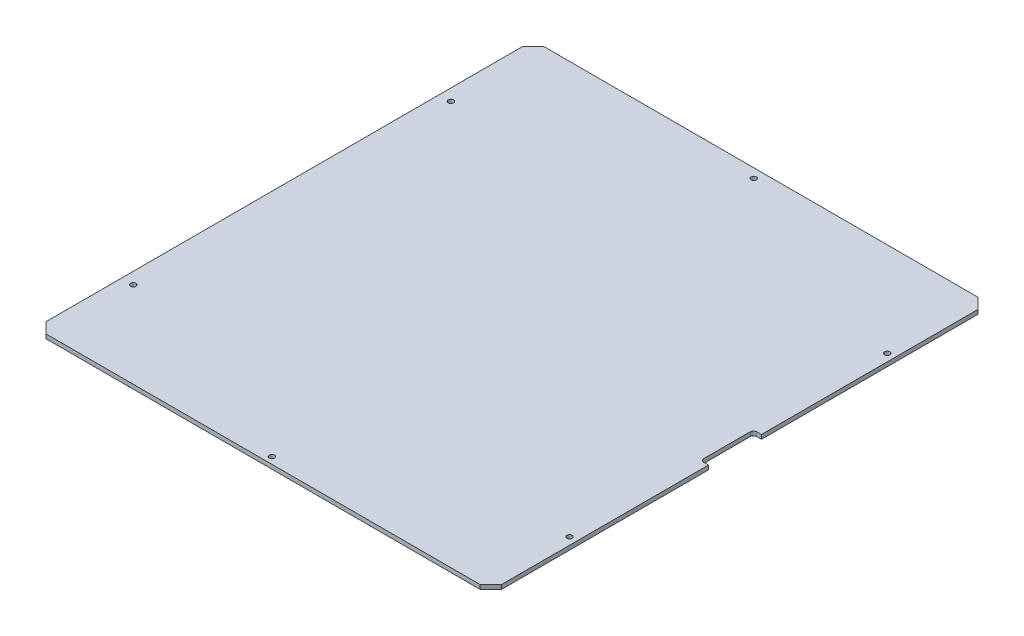
ISO-10303-21;
HEADER;
FILE_DESCRIPTION(('STEP AP214'),'2;1');
FILE_NAME('part.step','',(''),(''),'','','');
FILE_SCHEMA(('AUTOMOTIVE_DESIGN { 1 0 10303 214 1 1 1 1 }'));
ENDSEC;
DATA;
#1=APPLICATION_CONTEXT('core data for automotive mechanical design processes');
#2=APPLICATION_PROTOCOL_DEFINITION('international standard','automotive_design',2000,#1);
#3=PRODUCT_CONTEXT('',#1,'mechanical');
#4=PRODUCT('Part','Part','',(#3));
#5=PRODUCT_RELATED_PRODUCT_CATEGORY('part','',(#4));
#6=PRODUCT_DEFINITION_FORMATION('','',#4);
#7=PRODUCT_DEFINITION_CONTEXT('part definition',#1,'design');
#8=PRODUCT_DEFINITION('design','',#6,#7);
#9=PRODUCT_DEFINITION_SHAPE('','',#8);
#10=(LENGTH_UNIT() NAMED_UNIT(*) SI_UNIT(.MILLI.,.METRE.));
#11=(NAMED_UNIT(*) PLANE_ANGLE_UNIT() SI_UNIT($,.RADIAN.));
#12=(NAMED_UNIT(*) SI_UNIT($,.STERADIAN.) SOLID_ANGLE_UNIT());
#13=UNCERTAINTY_MEASURE_WITH_UNIT(LENGTH_MEASURE(1.E-05),#10,'distance_accuracy_value','');
#14=(GEOMETRIC_REPRESENTATION_CONTEXT(3) GLOBAL_UNCERTAINTY_ASSIGNED_CONTEXT((#13)) GLOBAL_UNIT_ASSIGNED_CONTEXT((#10,
#11,#12)) REPRESENTATION_CONTEXT('',''));
#15=CARTESIAN_POINT('',(0.,0.,0.));
#16=DIRECTION('',(0.,0.,1.));
#17=DIRECTION('',(1.,0.,0.));
#18=AXIS2_PLACEMENT_3D('',#15,#16,#17);
#19=CARTESIAN_POINT('',(0.,-176.5,0.));
#20=DIRECTION('',(0.,-1.,0.));
#21=DIRECTION('',(0.,0.,-1.));
#22=AXIS2_PLACEMENT_3D('',#19,#20,#21);
#23=PLANE('',#22);
#24=CARTESIAN_POINT('',(1.99999999999029,-176.5,686.5));
#25=DIRECTION('',(0.,-1.,0.));
#26=DIRECTION('',(0.,0.,-1.));
#27=AXIS2_PLACEMENT_3D('',#24,#25,#26);
#28=CIRCLE('',#27,2.49999999999995);
#29=CARTESIAN_POINT('',(1.99999999999029,-176.5,684.));
#30=VERTEX_POINT('',#29);
#31=EDGE_CURVE('E229',#30,#30,#28,.F.);
#32=ORIENTED_EDGE('',*,*,#31,.T.);
#33=EDGE_LOOP('',(#32));
#34=FACE_BOUND('',#33,.T.);
#35=CARTESIAN_POINT('',(207.99999999999,-176.5,611.5));
#36=DIRECTION('',(0.,-1.,0.));
#37=DIRECTION('',(0.,0.,-1.));
#38=AXIS2_PLACEMENT_3D('',#35,#36,#37);
#39=CIRCLE('',#38,2.49999999999995);
#40=CARTESIAN_POINT('',(207.99999999999,-176.5,609.));
#41=VERTEX_POINT('',#40);
#42=EDGE_CURVE('E301',#41,#41,#39,.F.);
#43=ORIENTED_EDGE('',*,*,#42,.T.);
#44=EDGE_LOOP('',(#43));
#45=FACE_BOUND('',#44,.T.);
#46=CARTESIAN_POINT('',(-204.00000000001,-176.5,311.5));
#47=DIRECTION('',(0.,-1.,0.));
#48=DIRECTION('',(0.,0.,-1.));
#49=AXIS2_PLACEMENT_3D('',#46,#47,#48);
#50=CIRCLE('',#49,2.5);
#51=CARTESIAN_POINT('',(-204.00000000001,-176.5,309.));
#52=VERTEX_POINT('',#51);
#53=EDGE_CURVE('E307',#52,#52,#50,.F.);
#54=ORIENTED_EDGE('',*,*,#53,.T.);
#55=EDGE_LOOP('',(#54));
#56=FACE_BOUND('',#55,.T.);
#57=CARTESIAN_POINT('',(1.99999999999029,-176.5,231.5));
#58=DIRECTION('',(0.,-1.,0.));
#59=DIRECTION('',(0.,0.,-1.));
#60=AXIS2_PLACEMENT_3D('',#57,#58,#59);
#61=CIRCLE('',#60,2.5);
#62=CARTESIAN_POINT('',(1.99999999999029,-176.5,229.));
#63=VERTEX_POINT('',#62);
#64=EDGE_CURVE('E245',#63,#63,#61,.F.);
#65=ORIENTED_EDGE('',*,*,#64,.T.);
#66=EDGE_LOOP('',(#65));
#67=FACE_BOUND('',#66,.T.);
#68=CARTESIAN_POINT('',(-204.00000000001,-176.5,611.5));
#69=DIRECTION('',(0.,-1.,0.));
#70=DIRECTION('',(0.,0.,-1.));
#71=AXIS2_PLACEMENT_3D('',#68,#69,#70);
#72=CIRCLE('',#71,2.49999999999995);
#73=CARTESIAN_POINT('',(-204.00000000001,-176.5,609.));
#74=VERTEX_POINT('',#73);
#75=EDGE_CURVE('E304',#74,#74,#72,.F.);
#76=ORIENTED_EDGE('',*,*,#75,.T.);
#77=EDGE_LOOP('',(#76));
#78=FACE_BOUND('',#77,.T.);
#79=CARTESIAN_POINT('',(207.99999999999,-176.5,311.5));
#80=DIRECTION('',(0.,-1.,0.));
#81=DIRECTION('',(0.,0.,-1.));
#82=AXIS2_PLACEMENT_3D('',#79,#80,#81);
#83=CIRCLE('',#82,2.5);
#84=CARTESIAN_POINT('',(207.99999999999,-176.5,309.));
#85=VERTEX_POINT('',#84);
#86=EDGE_CURVE('E298',#85,#85,#83,.F.);
#87=ORIENTED_EDGE('',*,*,#86,.T.);
#88=EDGE_LOOP('',(#87));
#89=FACE_BOUND('',#88,.T.);
#90=DIRECTION('',(0.,0.,1.));
#91=VECTOR('',#90,1.);
#92=CARTESIAN_POINT('',(207.500000000561,-176.5,440.250000000085));
#93=LINE('',#92,#91);
#94=CARTESIAN_POINT('',(207.500000000561,-176.5,440.250000000085));
#95=VERTEX_POINT('',#94);
#96=CARTESIAN_POINT('',(207.500000000561,-176.5,484.250000000085));
#97=VERTEX_POINT('',#96);
#98=EDGE_CURVE('E119',#95,#97,#93,.T.);
#99=ORIENTED_EDGE('',*,*,#98,.T.);
#100=CARTESIAN_POINT('',(210.500000000561,-176.5,484.250000000085));
#101=DIRECTION('',(0.,1.,0.));
#102=DIRECTION('',(0.,0.,1.));
#103=AXIS2_PLACEMENT_3D('',#100,#101,#102);
#104=CIRCLE('',#103,3.);
#105=CARTESIAN_POINT('',(210.500000000561,-176.5,487.250000000085));
#106=VERTEX_POINT('',#105);
#107=EDGE_CURVE('E311',#97,#106,#104,.T.);
#108=ORIENTED_EDGE('',*,*,#107,.T.);
#109=DIRECTION('',(1.,0.,0.));
#110=VECTOR('',#109,1.);
#111=CARTESIAN_POINT('',(210.500000000561,-176.5,487.250000000085));
#112=LINE('',#111,#110);
#113=CARTESIAN_POINT('',(215.,-176.5,487.250000000085));
#114=VERTEX_POINT('',#113);
#115=EDGE_CURVE('E235',#106,#114,#112,.T.);
#116=ORIENTED_EDGE('',*,*,#115,.T.);
#117=DIRECTION('',(0.,0.,1.));
#118=VECTOR('',#117,1.);
#119=CARTESIAN_POINT('',(215.,-176.5,232.8));
#120=LINE('',#119,#118);
#121=CARTESIAN_POINT('',(215.,-176.5,682.8));
#122=VERTEX_POINT('',#121);
#123=EDGE_CURVE('E242',#114,#122,#120,.T.);
#124=ORIENTED_EDGE('',*,*,#123,.T.);
#125=DIRECTION('',(-0.707106781186548,0.,0.707106781186548));
#126=VECTOR('',#125,1.);
#127=CARTESIAN_POINT('',(215.,-176.5,682.8));
#128=LINE('',#127,#126);
#129=CARTESIAN_POINT('',(205.,-176.5,692.8));
#130=VERTEX_POINT('',#129);
#131=EDGE_CURVE('E224',#122,#130,#128,.T.);
#132=ORIENTED_EDGE('',*,*,#131,.T.);
#133=DIRECTION('',(-1.,0.,0.));
#134=VECTOR('',#133,1.);
#135=CARTESIAN_POINT('',(-205.,-176.5,692.8));
#136=LINE('',#135,#134);
#137=CARTESIAN_POINT('',(-205.,-176.5,692.8));
#138=VERTEX_POINT('',#137);
#139=EDGE_CURVE('E213',#130,#138,#136,.T.);
#140=ORIENTED_EDGE('',*,*,#139,.T.);
#141=DIRECTION('',(-0.707106781186549,0.,-0.707106781186547));
#142=VECTOR('',#141,1.);
#143=CARTESIAN_POINT('',(-215.,-176.5,682.8));
#144=LINE('',#143,#142);
#145=CARTESIAN_POINT('',(-215.,-176.5,682.8));
#146=VERTEX_POINT('',#145);
#147=EDGE_CURVE('E202',#138,#146,#144,.T.);
#148=ORIENTED_EDGE('',*,*,#147,.T.);
#149=DIRECTION('',(0.,0.,-1.));
#150=VECTOR('',#149,1.);
#151=CARTESIAN_POINT('',(-215.,-176.5,232.8));
#152=LINE('',#151,#150);
#153=CARTESIAN_POINT('',(-215.,-176.5,232.8));
#154=VERTEX_POINT('',#153);
#155=EDGE_CURVE('E191',#146,#154,#152,.T.);
#156=ORIENTED_EDGE('',*,*,#155,.T.);
#157=DIRECTION('',(0.707106781186548,0.,-0.707106781186548));
#158=VECTOR('',#157,1.);
#159=CARTESIAN_POINT('',(-215.,-176.5,232.8));
#160=LINE('',#159,#158);
#161=CARTESIAN_POINT('',(-205.,-176.5,222.8));
#162=VERTEX_POINT('',#161);
#163=EDGE_CURVE('E180',#154,#162,#160,.T.);
#164=ORIENTED_EDGE('',*,*,#163,.T.);
#165=DIRECTION('',(1.,0.,0.));
#166=VECTOR('',#165,1.);
#167=CARTESIAN_POINT('',(-205.,-176.5,222.8));
#168=LINE('',#167,#166);
#169=CARTESIAN_POINT('',(205.,-176.5,222.8));
#170=VERTEX_POINT('',#169);
#171=EDGE_CURVE('E169',#162,#170,#168,.T.);
#172=ORIENTED_EDGE('',*,*,#171,.T.);
#173=DIRECTION('',(0.707106781186542,0.,0.707106781186553));
#174=VECTOR('',#173,1.);
#175=CARTESIAN_POINT('',(205.,-176.5,222.8));
#176=LINE('',#175,#174);
#177=CARTESIAN_POINT('',(215.,-176.5,232.8));
#178=VERTEX_POINT('',#177);
#179=EDGE_CURVE('E158',#170,#178,#176,.T.);
#180=ORIENTED_EDGE('',*,*,#179,.T.);
#181=DIRECTION('',(0.,0.,1.));
#182=VECTOR('',#181,1.);
#183=CARTESIAN_POINT('',(215.,-176.5,232.8));
#184=LINE('',#183,#182);
#185=CARTESIAN_POINT('',(215.,-176.5,437.250000000086));
#186=VERTEX_POINT('',#185);
#187=EDGE_CURVE('E145',#178,#186,#184,.T.);
#188=ORIENTED_EDGE('',*,*,#187,.T.);
#189=DIRECTION('',(-1.,0.,0.));
#190=VECTOR('',#189,1.);
#191=CARTESIAN_POINT('',(210.500000000561,-176.5,437.250000000085));
#192=LINE('',#191,#190);
#193=CARTESIAN_POINT('',(210.500000000561,-176.5,437.250000000085));
#194=VERTEX_POINT('',#193);
#195=EDGE_CURVE('E116',#186,#194,#192,.T.);
#196=ORIENTED_EDGE('',*,*,#195,.T.);
#197=CARTESIAN_POINT('',(210.500000000561,-176.5,440.250000000085));
#198=DIRECTION('',(0.,1.,0.));
#199=DIRECTION('',(0.,0.,1.));
#200=AXIS2_PLACEMENT_3D('',#197,#198,#199);
#201=CIRCLE('',#200,3.);
#202=EDGE_CURVE('E20',#194,#95,#201,.T.);
#203=ORIENTED_EDGE('',*,*,#202,.T.);
#204=EDGE_LOOP('',(#99,#108,#116,#124,#132,#140,#148,#156,#164,#172,#180,#188,#196,#203));
#205=FACE_BOUND('',#204,.T.);
#206=ADVANCED_FACE('F17',(#34,#45,#56,#67,#78,#89,#205),#23,.T.);
#207=CARTESIAN_POINT('',(215.,-172.5,682.8));
#208=DIRECTION('',(-0.707106781186548,0.,-0.707106781186548));
#209=DIRECTION('',(-0.707106781186548,0.,0.707106781186548));
#210=AXIS2_PLACEMENT_3D('',#207,#208,#209);
#211=PLANE('',#210);
#212=DIRECTION('',(0.,1.,0.));
#213=VECTOR('',#212,1.);
#214=CARTESIAN_POINT('',(215.,-172.5,682.8));
#215=LINE('',#214,#213);
#216=CARTESIAN_POINT('',(215.,-172.5,682.8));
#217=VERTEX_POINT('',#216);
#218=EDGE_CURVE('E232',#122,#217,#215,.T.);
#219=ORIENTED_EDGE('',*,*,#218,.T.);
#220=DIRECTION('',(-0.707106781186547,0.,0.707106781186547));
#221=VECTOR('',#220,1.);
#222=CARTESIAN_POINT('',(215.,-172.5,682.8));
#223=LINE('',#222,#221);
#224=CARTESIAN_POINT('',(205.,-172.5,692.8));
#225=VERTEX_POINT('',#224);
#226=EDGE_CURVE('E218',#217,#225,#223,.T.);
#227=ORIENTED_EDGE('',*,*,#226,.T.);
#228=DIRECTION('',(0.,1.,0.));
#229=VECTOR('',#228,1.);
#230=CARTESIAN_POINT('',(205.,-172.5,692.8));
#231=LINE('',#230,#229);
#232=EDGE_CURVE('E221',#225,#130,#231,.F.);
#233=ORIENTED_EDGE('',*,*,#232,.T.);
#234=ORIENTED_EDGE('',*,*,#131,.F.);
#235=EDGE_LOOP('',(#219,#227,#233,#234));
#236=FACE_BOUND('',#235,.T.);
#237=ADVANCED_FACE('F368',(#236),#211,.F.);
#238=CARTESIAN_POINT('',(-205.,-172.5,692.8));
#239=DIRECTION('',(0.,0.,-1.));
#240=DIRECTION('',(-1.,0.,0.));
#241=AXIS2_PLACEMENT_3D('',#238,#239,#240);
#242=PLANE('',#241);
#243=ORIENTED_EDGE('',*,*,#232,.F.);
#244=DIRECTION('',(1.,0.,0.));
#245=VECTOR('',#244,1.);
#246=CARTESIAN_POINT('',(0.,-172.5,692.8));
#247=LINE('',#246,#245);
#248=CARTESIAN_POINT('',(-205.,-172.5,692.8));
#249=VERTEX_POINT('',#248);
#250=EDGE_CURVE('E207',#225,#249,#247,.F.);
#251=ORIENTED_EDGE('',*,*,#250,.T.);
#252=DIRECTION('',(0.,1.,0.));
#253=VECTOR('',#252,1.);
#254=CARTESIAN_POINT('',(-205.,-172.5,692.8));
#255=LINE('',#254,#253);
#256=EDGE_CURVE('E210',#249,#138,#255,.F.);
#257=ORIENTED_EDGE('',*,*,#256,.T.);
#258=ORIENTED_EDGE('',*,*,#139,.F.);
#259=EDGE_LOOP('',(#243,#251,#257,#258));
#260=FACE_BOUND('',#259,.T.);
#261=ADVANCED_FACE('F365',(#260),#242,.F.);
#262=CARTESIAN_POINT('',(-215.,-172.5,682.8));
#263=DIRECTION('',(0.707106781186547,0.,-0.707106781186549));
#264=DIRECTION('',(-0.707106781186549,0.,-0.707106781186547));
#265=AXIS2_PLACEMENT_3D('',#262,#263,#264);
#266=PLANE('',#265);
#267=ORIENTED_EDGE('',*,*,#256,.F.);
#268=DIRECTION('',(-0.707106781186547,0.,-0.707106781186547));
#269=VECTOR('',#268,1.);
#270=CARTESIAN_POINT('',(-205.,-172.5,692.8));
#271=LINE('',#270,#269);
#272=CARTESIAN_POINT('',(-215.,-172.5,682.8));
#273=VERTEX_POINT('',#272);
#274=EDGE_CURVE('E196',#249,#273,#271,.T.);
#275=ORIENTED_EDGE('',*,*,#274,.T.);
#276=DIRECTION('',(0.,1.,0.));
#277=VECTOR('',#276,1.);
#278=CARTESIAN_POINT('',(-215.,-172.5,682.8));
#279=LINE('',#278,#277);
#280=EDGE_CURVE('E199',#273,#146,#279,.F.);
#281=ORIENTED_EDGE('',*,*,#280,.T.);
#282=ORIENTED_EDGE('',*,*,#147,.F.);
#283=EDGE_LOOP('',(#267,#275,#281,#282));
#284=FACE_BOUND('',#283,.T.);
#285=ADVANCED_FACE('F362',(#284),#266,.F.);
#286=CARTESIAN_POINT('',(-215.,-172.5,232.8));
#287=DIRECTION('',(1.,0.,0.));
#288=DIRECTION('',(0.,0.,-1.));
#289=AXIS2_PLACEMENT_3D('',#286,#287,#288);
#290=PLANE('',#289);
#291=ORIENTED_EDGE('',*,*,#280,.F.);
#292=DIRECTION('',(0.,0.,-1.));
#293=VECTOR('',#292,1.);
#294=CARTESIAN_POINT('',(-215.,-172.5,0.));
#295=LINE('',#294,#293);
#296=CARTESIAN_POINT('',(-215.,-172.5,232.8));
#297=VERTEX_POINT('',#296);
#298=EDGE_CURVE('E185',#273,#297,#295,.T.);
#299=ORIENTED_EDGE('',*,*,#298,.T.);
#300=DIRECTION('',(0.,1.,0.));
#301=VECTOR('',#300,1.);
#302=CARTESIAN_POINT('',(-215.,-172.5,232.8));
#303=LINE('',#302,#301);
#304=EDGE_CURVE('E188',#297,#154,#303,.F.);
#305=ORIENTED_EDGE('',*,*,#304,.T.);
#306=ORIENTED_EDGE('',*,*,#155,.F.);
#307=EDGE_LOOP('',(#291,#299,#305,#306));
#308=FACE_BOUND('',#307,.T.);
#309=ADVANCED_FACE('F358',(#308),#290,.F.);
#310=CARTESIAN_POINT('',(-215.,-172.5,232.8));
#311=DIRECTION('',(0.707106781186548,0.,0.707106781186548));
#312=DIRECTION('',(0.707106781186548,0.,-0.707106781186548));
#313=AXIS2_PLACEMENT_3D('',#310,#311,#312);
#314=PLANE('',#313);
#315=ORIENTED_EDGE('',*,*,#304,.F.);
#316=DIRECTION('',(0.707106781186547,0.,-0.707106781186547));
#317=VECTOR('',#316,1.);
#318=CARTESIAN_POINT('',(-215.,-172.5,232.8));
#319=LINE('',#318,#317);
#320=CARTESIAN_POINT('',(-205.,-172.5,222.8));
#321=VERTEX_POINT('',#320);
#322=EDGE_CURVE('E174',#297,#321,#319,.T.);
#323=ORIENTED_EDGE('',*,*,#322,.T.);
#324=DIRECTION('',(0.,1.,0.));
#325=VECTOR('',#324,1.);
#326=CARTESIAN_POINT('',(-205.,-172.5,222.8));
#327=LINE('',#326,#325);
#328=EDGE_CURVE('E177',#321,#162,#327,.F.);
#329=ORIENTED_EDGE('',*,*,#328,.T.);
#330=ORIENTED_EDGE('',*,*,#163,.F.);
#331=EDGE_LOOP('',(#315,#323,#329,#330));
#332=FACE_BOUND('',#331,.T.);
#333=ADVANCED_FACE('F354',(#332),#314,.F.);
#334=CARTESIAN_POINT('',(-205.,-172.5,222.8));
#335=DIRECTION('',(0.,0.,1.));
#336=DIRECTION('',(1.,0.,0.));
#337=AXIS2_PLACEMENT_3D('',#334,#335,#336);
#338=PLANE('',#337);
#339=ORIENTED_EDGE('',*,*,#328,.F.);
#340=DIRECTION('',(1.,0.,0.));
#341=VECTOR('',#340,1.);
#342=CARTESIAN_POINT('',(0.,-172.5,222.8));
#343=LINE('',#342,#341);
#344=CARTESIAN_POINT('',(205.,-172.5,222.8));
#345=VERTEX_POINT('',#344);
#346=EDGE_CURVE('E163',#321,#345,#343,.T.);
#347=ORIENTED_EDGE('',*,*,#346,.T.);
#348=DIRECTION('',(0.,1.,0.));
#349=VECTOR('',#348,1.);
#350=CARTESIAN_POINT('',(205.,-172.5,222.8));
#351=LINE('',#350,#349);
#352=EDGE_CURVE('E166',#345,#170,#351,.F.);
#353=ORIENTED_EDGE('',*,*,#352,.T.);
#354=ORIENTED_EDGE('',*,*,#171,.F.);
#355=EDGE_LOOP('',(#339,#347,#353,#354));
#356=FACE_BOUND('',#355,.T.);
#357=ADVANCED_FACE('F350',(#356),#338,.F.);
#358=CARTESIAN_POINT('',(205.,-172.5,222.8));
#359=DIRECTION('',(-0.707106781186553,0.,0.707106781186542));
#360=DIRECTION('',(0.707106781186542,0.,0.707106781186553));
#361=AXIS2_PLACEMENT_3D('',#358,#359,#360);
#362=PLANE('',#361);
#363=ORIENTED_EDGE('',*,*,#352,.F.);
#364=DIRECTION('',(0.707106781186542,0.,0.707106781186553));
#365=VECTOR('',#364,1.);
#366=CARTESIAN_POINT('',(205.,-172.5,222.8));
#367=LINE('',#366,#365);
#368=CARTESIAN_POINT('',(215.,-172.5,232.8));
#369=VERTEX_POINT('',#368);
#370=EDGE_CURVE('E152',#345,#369,#367,.T.);
#371=ORIENTED_EDGE('',*,*,#370,.T.);
#372=DIRECTION('',(0.,1.,0.));
#373=VECTOR('',#372,1.);
#374=CARTESIAN_POINT('',(215.,-172.5,232.8));
#375=LINE('',#374,#373);
#376=EDGE_CURVE('E155',#369,#178,#375,.F.);
#377=ORIENTED_EDGE('',*,*,#376,.T.);
#378=ORIENTED_EDGE('',*,*,#179,.F.);
#379=EDGE_LOOP('',(#363,#371,#377,#378));
#380=FACE_BOUND('',#379,.T.);
#381=ADVANCED_FACE('F346',(#380),#362,.F.);
#382=CARTESIAN_POINT('',(215.,-172.5,232.8));
#383=DIRECTION('',(-1.,0.,0.));
#384=DIRECTION('',(0.,0.,1.));
#385=AXIS2_PLACEMENT_3D('',#382,#383,#384);
#386=PLANE('',#385);
#387=DIRECTION('',(0.,1.,0.));
#388=VECTOR('',#387,1.);
#389=CARTESIAN_POINT('',(215.,-289.5,437.250000000085));
#390=LINE('',#389,#388);
#391=CARTESIAN_POINT('',(215.,-172.5,437.250000000086));
#392=VERTEX_POINT('',#391);
#393=EDGE_CURVE('E142',#392,#186,#390,.F.);
#394=ORIENTED_EDGE('',*,*,#393,.T.);
#395=ORIENTED_EDGE('',*,*,#187,.F.);
#396=ORIENTED_EDGE('',*,*,#376,.F.);
#397=DIRECTION('',(0.,0.,-1.));
#398=VECTOR('',#397,1.);
#399=CARTESIAN_POINT('',(215.,-172.5,0.));
#400=LINE('',#399,#398);
#401=EDGE_CURVE('E148',#369,#392,#400,.F.);
#402=ORIENTED_EDGE('',*,*,#401,.T.);
#403=EDGE_LOOP('',(#394,#395,#396,#402));
#404=FACE_BOUND('',#403,.T.);
#405=ADVANCED_FACE('F342',(#404),#386,.F.);
#406=CARTESIAN_POINT('',(210.500000000561,-289.5,437.250000000085));
#407=DIRECTION('',(0.,0.,-1.));
#408=DIRECTION('',(-1.,0.,0.));
#409=AXIS2_PLACEMENT_3D('',#406,#407,#408);
#410=PLANE('',#409);
#411=ORIENTED_EDGE('',*,*,#393,.F.);
#412=DIRECTION('',(1.,0.,0.));
#413=VECTOR('',#412,1.);
#414=CARTESIAN_POINT('',(0.,-172.5,437.250000000085));
#415=LINE('',#414,#413);
#416=CARTESIAN_POINT('',(210.500000000561,-172.5,437.250000000085));
#417=VERTEX_POINT('',#416);
#418=EDGE_CURVE('E151',#392,#417,#415,.F.);
#419=ORIENTED_EDGE('',*,*,#418,.T.);
#420=DIRECTION('',(0.,1.,0.));
#421=VECTOR('',#420,1.);
#422=CARTESIAN_POINT('',(210.500000000561,-289.5,437.250000000085));
#423=LINE('',#422,#421);
#424=EDGE_CURVE('E125',#417,#194,#423,.F.);
#425=ORIENTED_EDGE('',*,*,#424,.T.);
#426=ORIENTED_EDGE('',*,*,#195,.F.);
#427=EDGE_LOOP('',(#411,#419,#425,#426));
#428=FACE_BOUND('',#427,.T.);
#429=ADVANCED_FACE('F337',(#428),#410,.F.);
#430=CARTESIAN_POINT('',(210.500000000561,-289.5,440.250000000085));
#431=DIRECTION('',(0.,1.,0.));
#432=DIRECTION('',(0.,0.,1.));
#433=AXIS2_PLACEMENT_3D('',#430,#431,#432);
#434=CYLINDRICAL_SURFACE('',#433,3.);
#435=ORIENTED_EDGE('',*,*,#424,.F.);
#436=CARTESIAN_POINT('',(210.500000000561,-172.5,440.250000000085));
#437=DIRECTION('',(0.,1.,0.));
#438=DIRECTION('',(0.,0.,1.));
#439=AXIS2_PLACEMENT_3D('',#436,#437,#438);
#440=CIRCLE('',#439,3.);
#441=CARTESIAN_POINT('',(207.500000000561,-172.5,440.250000000085));
#442=VERTEX_POINT('',#441);
#443=EDGE_CURVE('E136',#417,#442,#440,.T.);
#444=ORIENTED_EDGE('',*,*,#443,.T.);
#445=DIRECTION('',(0.,1.,0.));
#446=VECTOR('',#445,1.);
#447=CARTESIAN_POINT('',(207.500000000561,-289.5,440.250000000085));
#448=LINE('',#447,#446);
#449=EDGE_CURVE('E124',#442,#95,#448,.F.);
#450=ORIENTED_EDGE('',*,*,#449,.T.);
#451=ORIENTED_EDGE('',*,*,#202,.F.);
#452=EDGE_LOOP('',(#435,#444,#450,#451));
#453=FACE_BOUND('',#452,.T.);
#454=ADVANCED_FACE('F134',(#453),#434,.F.);
#455=CARTESIAN_POINT('',(207.500000000561,-289.5,440.250000000085));
#456=DIRECTION('',(-1.,0.,0.));
#457=DIRECTION('',(0.,0.,1.));
#458=AXIS2_PLACEMENT_3D('',#455,#456,#457);
#459=PLANE('',#458);
#460=ORIENTED_EDGE('',*,*,#449,.F.);
#461=DIRECTION('',(0.,0.,-1.));
#462=VECTOR('',#461,1.);
#463=CARTESIAN_POINT('',(207.500000000561,-172.5,0.));
#464=LINE('',#463,#462);
#465=CARTESIAN_POINT('',(207.500000000561,-172.5,484.250000000085));
#466=VERTEX_POINT('',#465);
#467=EDGE_CURVE('E294',#442,#466,#464,.F.);
#468=ORIENTED_EDGE('',*,*,#467,.T.);
#469=DIRECTION('',(0.,1.,0.));
#470=VECTOR('',#469,1.);
#471=CARTESIAN_POINT('',(207.500000000561,-289.5,484.250000000085));
#472=LINE('',#471,#470);
#473=EDGE_CURVE('E131',#466,#97,#472,.F.);
#474=ORIENTED_EDGE('',*,*,#473,.T.);
#475=ORIENTED_EDGE('',*,*,#98,.F.);
#476=EDGE_LOOP('',(#460,#468,#474,#475));
#477=FACE_BOUND('',#476,.T.);
#478=ADVANCED_FACE('F128',(#477),#459,.F.);
#479=CARTESIAN_POINT('',(210.500000000561,-289.5,484.250000000085));
#480=DIRECTION('',(0.,1.,0.));
#481=DIRECTION('',(0.,0.,1.));
#482=AXIS2_PLACEMENT_3D('',#479,#480,#481);
#483=CYLINDRICAL_SURFACE('',#482,3.);
#484=ORIENTED_EDGE('',*,*,#473,.F.);
#485=CARTESIAN_POINT('',(210.500000000561,-172.5,484.250000000085));
#486=DIRECTION('',(0.,1.,0.));
#487=DIRECTION('',(0.,0.,1.));
#488=AXIS2_PLACEMENT_3D('',#485,#486,#487);
#489=CIRCLE('',#488,3.);
#490=CARTESIAN_POINT('',(210.500000000561,-172.5,487.250000000085));
#491=VERTEX_POINT('',#490);
#492=EDGE_CURVE('E290',#466,#491,#489,.T.);
#493=ORIENTED_EDGE('',*,*,#492,.T.);
#494=DIRECTION('',(0.,1.,0.));
#495=VECTOR('',#494,1.);
#496=CARTESIAN_POINT('',(210.500000000561,-289.5,487.250000000085));
#497=LINE('',#496,#495);
#498=EDGE_CURVE('E239',#491,#106,#497,.F.);
#499=ORIENTED_EDGE('',*,*,#498,.T.);
#500=ORIENTED_EDGE('',*,*,#107,.F.);
#501=EDGE_LOOP('',(#484,#493,#499,#500));
#502=FACE_BOUND('',#501,.T.);
#503=ADVANCED_FACE('F382',(#502),#483,.F.);
#504=CARTESIAN_POINT('',(210.500000000561,-289.5,487.250000000085));
#505=DIRECTION('',(0.,0.,1.));
#506=DIRECTION('',(1.,0.,0.));
#507=AXIS2_PLACEMENT_3D('',#504,#505,#506);
#508=PLANE('',#507);
#509=ORIENTED_EDGE('',*,*,#498,.F.);
#510=DIRECTION('',(1.,0.,0.));
#511=VECTOR('',#510,1.);
#512=CARTESIAN_POINT('',(0.,-172.5,487.250000000085));
#513=LINE('',#512,#511);
#514=CARTESIAN_POINT('',(215.,-172.5,487.250000000085));
#515=VERTEX_POINT('',#514);
#516=EDGE_CURVE('E293',#491,#515,#513,.T.);
#517=ORIENTED_EDGE('',*,*,#516,.T.);
#518=DIRECTION('',(0.,1.,0.));
#519=VECTOR('',#518,1.);
#520=CARTESIAN_POINT('',(215.,-172.5,487.250000000085));
#521=LINE('',#520,#519);
#522=EDGE_CURVE('E35',#515,#114,#521,.F.);
#523=ORIENTED_EDGE('',*,*,#522,.T.);
#524=ORIENTED_EDGE('',*,*,#115,.F.);
#525=EDGE_LOOP('',(#509,#517,#523,#524));
#526=FACE_BOUND('',#525,.T.);
#527=ADVANCED_FACE('F326',(#526),#508,.F.);
#528=CARTESIAN_POINT('',(215.,-172.5,232.8));
#529=DIRECTION('',(-1.,0.,0.));
#530=DIRECTION('',(0.,0.,1.));
#531=AXIS2_PLACEMENT_3D('',#528,#529,#530);
#532=PLANE('',#531);
#533=ORIENTED_EDGE('',*,*,#522,.F.);
#534=DIRECTION('',(0.,0.,-1.));
#535=VECTOR('',#534,1.);
#536=CARTESIAN_POINT('',(215.,-172.5,0.));
#537=LINE('',#536,#535);
#538=EDGE_CURVE('E289',#515,#217,#537,.F.);
#539=ORIENTED_EDGE('',*,*,#538,.T.);
#540=ORIENTED_EDGE('',*,*,#218,.F.);
#541=ORIENTED_EDGE('',*,*,#123,.F.);
#542=EDGE_LOOP('',(#533,#539,#540,#541));
#543=FACE_BOUND('',#542,.T.);
#544=ADVANCED_FACE('F370',(#543),#532,.F.);
#545=CARTESIAN_POINT('',(1.99999999999029,-172.5,231.5));
#546=DIRECTION('',(0.,-1.,0.));
#547=DIRECTION('',(0.,0.,-1.));
#548=AXIS2_PLACEMENT_3D('',#545,#546,#547);
#549=CYLINDRICAL_SURFACE('',#548,2.5);
#550=ORIENTED_EDGE('',*,*,#64,.F.);
#551=EDGE_LOOP('',(#550));
#552=FACE_BOUND('',#551,.T.);
#553=CARTESIAN_POINT('',(1.99999999999029,-172.5,231.5));
#554=DIRECTION('',(0.,-1.,0.));
#555=DIRECTION('',(0.,0.,-1.));
#556=AXIS2_PLACEMENT_3D('',#553,#554,#555);
#557=CIRCLE('',#556,2.5);
#558=CARTESIAN_POINT('',(1.99999999999029,-172.5,229.));
#559=VERTEX_POINT('',#558);
#560=EDGE_CURVE('E286',#559,#559,#557,.F.);
#561=ORIENTED_EDGE('',*,*,#560,.T.);
#562=EDGE_LOOP('',(#561));
#563=FACE_BOUND('',#562,.T.);
#564=ADVANCED_FACE('F372',(#552,#563),#549,.F.);
#565=CARTESIAN_POINT('',(-204.00000000001,-172.5,311.5));
#566=DIRECTION('',(0.,-1.,0.));
#567=DIRECTION('',(0.,0.,-1.));
#568=AXIS2_PLACEMENT_3D('',#565,#566,#567);
#569=CYLINDRICAL_SURFACE('',#568,2.5);
#570=ORIENTED_EDGE('',*,*,#53,.F.);
#571=EDGE_LOOP('',(#570));
#572=FACE_BOUND('',#571,.T.);
#573=CARTESIAN_POINT('',(-204.00000000001,-172.5,311.5));
#574=DIRECTION('',(0.,-1.,0.));
#575=DIRECTION('',(0.,0.,-1.));
#576=AXIS2_PLACEMENT_3D('',#573,#574,#575);
#577=CIRCLE('',#576,2.5);
#578=CARTESIAN_POINT('',(-204.00000000001,-172.5,309.));
#579=VERTEX_POINT('',#578);
#580=EDGE_CURVE('E283',#579,#579,#577,.F.);
#581=ORIENTED_EDGE('',*,*,#580,.T.);
#582=EDGE_LOOP('',(#581));
#583=FACE_BOUND('',#582,.T.);
#584=ADVANCED_FACE('F379',(#572,#583),#569,.F.);
#585=CARTESIAN_POINT('',(-204.00000000001,-172.5,611.5));
#586=DIRECTION('',(0.,-1.,0.));
#587=DIRECTION('',(0.,0.,-1.));
#588=AXIS2_PLACEMENT_3D('',#585,#586,#587);
#589=CYLINDRICAL_SURFACE('',#588,2.49999999999995);
#590=ORIENTED_EDGE('',*,*,#75,.F.);
#591=EDGE_LOOP('',(#590));
#592=FACE_BOUND('',#591,.T.);
#593=CARTESIAN_POINT('',(-204.00000000001,-172.5,611.5));
#594=DIRECTION('',(0.,-1.,0.));
#595=DIRECTION('',(0.,0.,-1.));
#596=AXIS2_PLACEMENT_3D('',#593,#594,#595);
#597=CIRCLE('',#596,2.49999999999995);
#598=CARTESIAN_POINT('',(-204.00000000001,-172.5,609.));
#599=VERTEX_POINT('',#598);
#600=EDGE_CURVE('E280',#599,#599,#597,.F.);
#601=ORIENTED_EDGE('',*,*,#600,.T.);
#602=EDGE_LOOP('',(#601));
#603=FACE_BOUND('',#602,.T.);
#604=ADVANCED_FACE('F403',(#592,#603),#589,.F.);
#605=CARTESIAN_POINT('',(207.99999999999,-172.5,611.5));
#606=DIRECTION('',(0.,-1.,0.));
#607=DIRECTION('',(0.,0.,-1.));
#608=AXIS2_PLACEMENT_3D('',#605,#606,#607);
#609=CYLINDRICAL_SURFACE('',#608,2.49999999999995);
#610=ORIENTED_EDGE('',*,*,#42,.F.);
#611=EDGE_LOOP('',(#610));
#612=FACE_BOUND('',#611,.T.);
#613=CARTESIAN_POINT('',(207.99999999999,-172.5,611.5));
#614=DIRECTION('',(0.,-1.,0.));
#615=DIRECTION('',(0.,0.,-1.));
#616=AXIS2_PLACEMENT_3D('',#613,#614,#615);
#617=CIRCLE('',#616,2.49999999999995);
#618=CARTESIAN_POINT('',(207.99999999999,-172.5,609.));
#619=VERTEX_POINT('',#618);
#620=EDGE_CURVE('E277',#619,#619,#617,.F.);
#621=ORIENTED_EDGE('',*,*,#620,.T.);
#622=EDGE_LOOP('',(#621));
#623=FACE_BOUND('',#622,.T.);
#624=ADVANCED_FACE('F399',(#612,#623),#609,.F.);
#625=CARTESIAN_POINT('',(207.99999999999,-172.5,311.5));
#626=DIRECTION('',(0.,-1.,0.));
#627=DIRECTION('',(0.,0.,-1.));
#628=AXIS2_PLACEMENT_3D('',#625,#626,#627);
#629=CYLINDRICAL_SURFACE('',#628,2.5);
#630=ORIENTED_EDGE('',*,*,#86,.F.);
#631=EDGE_LOOP('',(#630));
#632=FACE_BOUND('',#631,.T.);
#633=CARTESIAN_POINT('',(207.99999999999,-172.5,311.5));
#634=DIRECTION('',(0.,-1.,0.));
#635=DIRECTION('',(0.,0.,-1.));
#636=AXIS2_PLACEMENT_3D('',#633,#634,#635);
#637=CIRCLE('',#636,2.5);
#638=CARTESIAN_POINT('',(207.99999999999,-172.5,309.));
#639=VERTEX_POINT('',#638);
#640=EDGE_CURVE('E26',#639,#639,#637,.F.);
#641=ORIENTED_EDGE('',*,*,#640,.T.);
#642=EDGE_LOOP('',(#641));
#643=FACE_BOUND('',#642,.T.);
#644=ADVANCED_FACE('F391',(#632,#643),#629,.F.);
#645=CARTESIAN_POINT('',(1.99999999999029,-172.5,686.5));
#646=DIRECTION('',(0.,-1.,0.));
#647=DIRECTION('',(0.,0.,-1.));
#648=AXIS2_PLACEMENT_3D('',#645,#646,#647);
#649=CYLINDRICAL_SURFACE('',#648,2.49999999999995);
#650=ORIENTED_EDGE('',*,*,#31,.F.);
#651=EDGE_LOOP('',(#650));
#652=FACE_BOUND('',#651,.T.);
#653=CARTESIAN_POINT('',(1.99999999999029,-172.5,686.5));
#654=DIRECTION('',(0.,-1.,0.));
#655=DIRECTION('',(0.,0.,-1.));
#656=AXIS2_PLACEMENT_3D('',#653,#654,#655);
#657=CIRCLE('',#656,2.49999999999995);
#658=CARTESIAN_POINT('',(1.99999999999029,-172.5,684.));
#659=VERTEX_POINT('',#658);
#660=EDGE_CURVE('E10',#659,#659,#657,.F.);
#661=ORIENTED_EDGE('',*,*,#660,.T.);
#662=EDGE_LOOP('',(#661));
#663=FACE_BOUND('',#662,.T.);
#664=ADVANCED_FACE('F385',(#652,#663),#649,.F.);
#665=CARTESIAN_POINT('',(0.,-172.5,0.));
#666=DIRECTION('',(0.,-1.,0.));
#667=DIRECTION('',(0.,0.,-1.));
#668=AXIS2_PLACEMENT_3D('',#665,#666,#667);
#669=PLANE('',#668);
#670=ORIENTED_EDGE('',*,*,#660,.F.);
#671=EDGE_LOOP('',(#670));
#672=FACE_BOUND('',#671,.T.);
#673=ORIENTED_EDGE('',*,*,#640,.F.);
#674=EDGE_LOOP('',(#673));
#675=FACE_BOUND('',#674,.T.);
#676=ORIENTED_EDGE('',*,*,#620,.F.);
#677=EDGE_LOOP('',(#676));
#678=FACE_BOUND('',#677,.T.);
#679=ORIENTED_EDGE('',*,*,#600,.F.);
#680=EDGE_LOOP('',(#679));
#681=FACE_BOUND('',#680,.T.);
#682=ORIENTED_EDGE('',*,*,#580,.F.);
#683=EDGE_LOOP('',(#682));
#684=FACE_BOUND('',#683,.T.);
#685=ORIENTED_EDGE('',*,*,#560,.F.);
#686=EDGE_LOOP('',(#685));
#687=FACE_BOUND('',#686,.T.);
#688=ORIENTED_EDGE('',*,*,#516,.F.);
#689=ORIENTED_EDGE('',*,*,#492,.F.);
#690=ORIENTED_EDGE('',*,*,#467,.F.);
#691=ORIENTED_EDGE('',*,*,#443,.F.);
#692=ORIENTED_EDGE('',*,*,#418,.F.);
#693=ORIENTED_EDGE('',*,*,#401,.F.);
#694=ORIENTED_EDGE('',*,*,#370,.F.);
#695=ORIENTED_EDGE('',*,*,#346,.F.);
#696=ORIENTED_EDGE('',*,*,#322,.F.);
#697=ORIENTED_EDGE('',*,*,#298,.F.);
#698=ORIENTED_EDGE('',*,*,#274,.F.);
#699=ORIENTED_EDGE('',*,*,#250,.F.);
#700=ORIENTED_EDGE('',*,*,#226,.F.);
#701=ORIENTED_EDGE('',*,*,#538,.F.);
#702=EDGE_LOOP('',(#688,#689,#690,#691,#692,#693,#694,#695,#696,#697,#698,#699,#700,#701));
#703=FACE_BOUND('',#702,.T.);
#704=ADVANCED_FACE('F339',(#672,#675,#678,#681,#684,#687,#703),#669,.F.);
#705=CLOSED_SHELL('',(#206,#237,#261,#285,#309,#333,#357,#381,#405,#429,#454,#478,#503,#527,
#544,#564,#584,#604,#624,#644,#664,#704));
#706=MANIFOLD_SOLID_BREP('B1',#705);
#707=ADVANCED_BREP_SHAPE_REPRESENTATION('',(#18,#706),#14);
#708=SHAPE_DEFINITION_REPRESENTATION(#9,#707);
ENDSEC;
END-ISO-10303-21;
